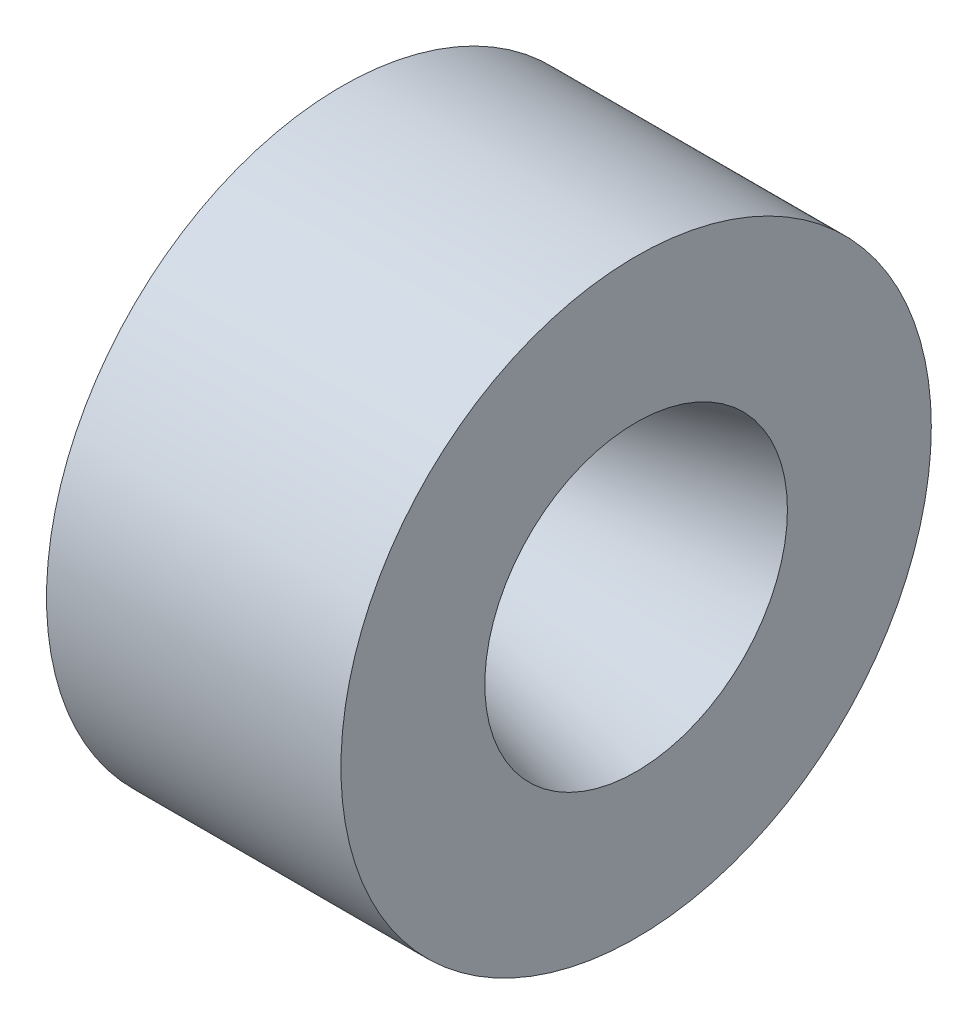
ISO-10303-21;
HEADER;
FILE_DESCRIPTION(('STEP AP214'),'2;1');
FILE_NAME('part.step','',(''),(''),'','','');
FILE_SCHEMA(('AUTOMOTIVE_DESIGN { 1 0 10303 214 1 1 1 1 }'));
ENDSEC;
DATA;
#1=APPLICATION_CONTEXT('core data for automotive mechanical design processes');
#2=APPLICATION_PROTOCOL_DEFINITION('international standard','automotive_design',2000,#1);
#3=PRODUCT_CONTEXT('',#1,'mechanical');
#4=PRODUCT('Part','Part','',(#3));
#5=PRODUCT_RELATED_PRODUCT_CATEGORY('part','',(#4));
#6=PRODUCT_DEFINITION_FORMATION('','',#4);
#7=PRODUCT_DEFINITION_CONTEXT('part definition',#1,'design');
#8=PRODUCT_DEFINITION('design','',#6,#7);
#9=PRODUCT_DEFINITION_SHAPE('','',#8);
#10=(LENGTH_UNIT() NAMED_UNIT(*) SI_UNIT(.MILLI.,.METRE.));
#11=(NAMED_UNIT(*) PLANE_ANGLE_UNIT() SI_UNIT($,.RADIAN.));
#12=(NAMED_UNIT(*) SI_UNIT($,.STERADIAN.) SOLID_ANGLE_UNIT());
#13=UNCERTAINTY_MEASURE_WITH_UNIT(LENGTH_MEASURE(1.E-05),#10,'distance_accuracy_value','');
#14=(GEOMETRIC_REPRESENTATION_CONTEXT(3) GLOBAL_UNCERTAINTY_ASSIGNED_CONTEXT((#13)) GLOBAL_UNIT_ASSIGNED_CONTEXT((#10,
#11,#12)) REPRESENTATION_CONTEXT('',''));
#15=CARTESIAN_POINT('',(0.,0.,0.));
#16=DIRECTION('',(0.,0.,1.));
#17=DIRECTION('',(1.,0.,0.));
#18=AXIS2_PLACEMENT_3D('',#15,#16,#17);
#19=CARTESIAN_POINT('',(152.7302,0.,0.));
#20=DIRECTION('',(1.,0.,0.));
#21=DIRECTION('',(0.,0.,-1.));
#22=AXIS2_PLACEMENT_3D('',#19,#20,#21);
#23=CYLINDRICAL_SURFACE('',#22,50.546);
#24=CARTESIAN_POINT('',(154.3304,0.,0.));
#25=DIRECTION('',(1.,0.,0.));
#26=DIRECTION('',(0.,0.,-1.));
#27=AXIS2_PLACEMENT_3D('',#24,#25,#26);
#28=CIRCLE('',#27,50.546);
#29=CARTESIAN_POINT('',(154.3304,0.,-50.546));
#30=VERTEX_POINT('',#29);
#31=EDGE_CURVE('E62',#30,#30,#28,.T.);
#32=ORIENTED_EDGE('',*,*,#31,.T.);
#33=EDGE_LOOP('',(#32));
#34=FACE_BOUND('',#33,.T.);
#35=CARTESIAN_POINT('',(204.742077662236,0.,0.));
#36=DIRECTION('',(1.,0.,0.));
#37=DIRECTION('',(0.,0.,-1.));
#38=AXIS2_PLACEMENT_3D('',#35,#36,#37);
#39=CIRCLE('',#38,50.546);
#40=CARTESIAN_POINT('',(204.742077662236,0.,-50.546));
#41=VERTEX_POINT('',#40);
#42=EDGE_CURVE('E74',#41,#41,#39,.T.);
#43=ORIENTED_EDGE('',*,*,#42,.F.);
#44=EDGE_LOOP('',(#43));
#45=FACE_BOUND('',#44,.T.);
#46=ADVANCED_FACE('F36',(#34,#45),#23,.T.);
#47=CARTESIAN_POINT('',(154.3304,50.546,0.));
#48=DIRECTION('',(-1.,0.,0.));
#49=DIRECTION('',(0.,0.,1.));
#50=AXIS2_PLACEMENT_3D('',#47,#48,#49);
#51=PLANE('',#50);
#52=CARTESIAN_POINT('',(154.3304,0.,0.));
#53=DIRECTION('',(-1.,0.,0.));
#54=DIRECTION('',(0.,0.,1.));
#55=AXIS2_PLACEMENT_3D('',#52,#53,#54);
#56=CIRCLE('',#55,43.942);
#57=CARTESIAN_POINT('',(154.3304,0.,43.942));
#58=VERTEX_POINT('',#57);
#59=EDGE_CURVE('E59',#58,#58,#56,.F.);
#60=ORIENTED_EDGE('',*,*,#59,.T.);
#61=EDGE_LOOP('',(#60));
#62=FACE_BOUND('',#61,.T.);
#63=ORIENTED_EDGE('',*,*,#31,.F.);
#64=EDGE_LOOP('',(#63));
#65=FACE_BOUND('',#64,.T.);
#66=ADVANCED_FACE('F82',(#62,#65),#51,.T.);
#67=CARTESIAN_POINT('',(152.7302,0.,0.));
#68=DIRECTION('',(1.,0.,0.));
#69=DIRECTION('',(0.,0.,-1.));
#70=AXIS2_PLACEMENT_3D('',#67,#68,#69);
#71=CYLINDRICAL_SURFACE('',#70,43.688);
#72=CARTESIAN_POINT('',(154.0764,0.,0.));
#73=DIRECTION('',(-1.,0.,0.));
#74=DIRECTION('',(0.,0.,1.));
#75=AXIS2_PLACEMENT_3D('',#72,#73,#74);
#76=CIRCLE('',#75,43.688);
#77=CARTESIAN_POINT('',(154.0764,0.,43.688));
#78=VERTEX_POINT('',#77);
#79=EDGE_CURVE('E56',#78,#78,#76,.T.);
#80=ORIENTED_EDGE('',*,*,#79,.T.);
#81=EDGE_LOOP('',(#80));
#82=FACE_BOUND('',#81,.T.);
#83=CARTESIAN_POINT('',(151.7904,0.,0.));
#84=DIRECTION('',(1.,0.,0.));
#85=DIRECTION('',(0.,0.,-1.));
#86=AXIS2_PLACEMENT_3D('',#83,#84,#85);
#87=CIRCLE('',#86,43.688);
#88=CARTESIAN_POINT('',(151.7904,0.,-43.688));
#89=VERTEX_POINT('',#88);
#90=EDGE_CURVE('E65',#89,#89,#87,.T.);
#91=ORIENTED_EDGE('',*,*,#90,.T.);
#92=EDGE_LOOP('',(#91));
#93=FACE_BOUND('',#92,.T.);
#94=ADVANCED_FACE('F88',(#82,#93),#71,.T.);
#95=CARTESIAN_POINT('',(151.7904,43.688,0.));
#96=DIRECTION('',(-1.,0.,0.));
#97=DIRECTION('',(0.,0.,1.));
#98=AXIS2_PLACEMENT_3D('',#95,#96,#97);
#99=PLANE('',#98);
#100=CARTESIAN_POINT('',(151.7904,0.,0.));
#101=DIRECTION('',(1.,0.,0.));
#102=DIRECTION('',(0.,0.,-1.));
#103=AXIS2_PLACEMENT_3D('',#100,#101,#102);
#104=CIRCLE('',#103,41.148);
#105=CARTESIAN_POINT('',(151.7904,0.,-41.148));
#106=VERTEX_POINT('',#105);
#107=EDGE_CURVE('E68',#106,#106,#104,.T.);
#108=ORIENTED_EDGE('',*,*,#107,.T.);
#109=EDGE_LOOP('',(#108));
#110=FACE_BOUND('',#109,.T.);
#111=ORIENTED_EDGE('',*,*,#90,.F.);
#112=EDGE_LOOP('',(#111));
#113=FACE_BOUND('',#112,.T.);
#114=ADVANCED_FACE('F118',(#110,#113),#99,.T.);
#115=CARTESIAN_POINT('',(152.7302,0.,0.));
#116=DIRECTION('',(1.,0.,0.));
#117=DIRECTION('',(0.,0.,-1.));
#118=AXIS2_PLACEMENT_3D('',#115,#116,#117);
#119=CYLINDRICAL_SURFACE('',#118,41.148);
#120=CARTESIAN_POINT('',(152.347039537398,0.,0.));
#121=DIRECTION('',(1.,0.,0.));
#122=DIRECTION('',(0.,0.,-1.));
#123=AXIS2_PLACEMENT_3D('',#120,#121,#122);
#124=CIRCLE('',#123,41.148);
#125=CARTESIAN_POINT('',(152.347039537398,0.,-41.148));
#126=VERTEX_POINT('',#125);
#127=EDGE_CURVE('E43',#126,#126,#124,.T.);
#128=ORIENTED_EDGE('',*,*,#127,.T.);
#129=EDGE_LOOP('',(#128));
#130=FACE_BOUND('',#129,.T.);
#131=ORIENTED_EDGE('',*,*,#107,.F.);
#132=EDGE_LOOP('',(#131));
#133=FACE_BOUND('',#132,.T.);
#134=ADVANCED_FACE('F110',(#130,#133),#119,.F.);
#135=CARTESIAN_POINT('',(154.3304,0.,0.));
#136=DIRECTION('',(-1.,0.,0.));
#137=DIRECTION('',(0.,0.,1.));
#138=AXIS2_PLACEMENT_3D('',#135,#136,#137);
#139=CONICAL_SURFACE('',#138,41.148,0.959931088596884);
#140=CARTESIAN_POINT('',(155.468008826139,0.,0.));
#141=DIRECTION('',(-1.,0.,0.));
#142=DIRECTION('',(0.,0.,1.));
#143=AXIS2_PLACEMENT_3D('',#140,#141,#142);
#144=CIRCLE('',#143,39.5233262224975);
#145=CARTESIAN_POINT('',(155.468008826139,0.,39.5233262224975));
#146=VERTEX_POINT('',#145);
#147=EDGE_CURVE('E10',#146,#146,#144,.T.);
#148=ORIENTED_EDGE('',*,*,#147,.T.);
#149=EDGE_LOOP('',(#148));
#150=FACE_BOUND('',#149,.T.);
#151=CARTESIAN_POINT('',(170.769703079932,0.,0.));
#152=DIRECTION('',(1.,0.,0.));
#153=DIRECTION('',(0.,0.,-1.));
#154=AXIS2_PLACEMENT_3D('',#151,#152,#153);
#155=CIRCLE('',#154,17.6702420741658);
#156=CARTESIAN_POINT('',(170.769703079932,0.,-17.6702420741658));
#157=VERTEX_POINT('',#156);
#158=EDGE_CURVE('E51',#157,#157,#155,.T.);
#159=ORIENTED_EDGE('',*,*,#158,.T.);
#160=EDGE_LOOP('',(#159));
#161=FACE_BOUND('',#160,.T.);
#162=ADVANCED_FACE('F107',(#150,#161),#139,.F.);
#163=CARTESIAN_POINT('',(171.279763711412,0.,0.));
#164=DIRECTION('',(1.,0.,0.));
#165=DIRECTION('',(0.,0.,-1.));
#166=AXIS2_PLACEMENT_3D('',#163,#164,#165);
#167=CONICAL_SURFACE('',#166,16.9418,0.26179938779915);
#168=CARTESIAN_POINT('',(172.138726363459,0.,0.));
#169=DIRECTION('',(-1.,0.,0.));
#170=DIRECTION('',(0.,0.,1.));
#171=AXIS2_PLACEMENT_3D('',#168,#169,#170);
#172=CIRCLE('',#171,17.1719583489445);
#173=CARTESIAN_POINT('',(172.138726363459,0.,17.1719583489445));
#174=VERTEX_POINT('',#173);
#175=EDGE_CURVE('E47',#174,#174,#172,.T.);
#176=ORIENTED_EDGE('',*,*,#175,.T.);
#177=EDGE_LOOP('',(#176));
#178=FACE_BOUND('',#177,.T.);
#179=CARTESIAN_POINT('',(204.742077662236,0.,0.));
#180=DIRECTION('',(1.,0.,0.));
#181=DIRECTION('',(0.,0.,-1.));
#182=AXIS2_PLACEMENT_3D('',#179,#180,#181);
#183=CIRCLE('',#182,25.908);
#184=CARTESIAN_POINT('',(204.742077662236,0.,-25.908));
#185=VERTEX_POINT('',#184);
#186=EDGE_CURVE('E71',#185,#185,#183,.T.);
#187=ORIENTED_EDGE('',*,*,#186,.T.);
#188=EDGE_LOOP('',(#187));
#189=FACE_BOUND('',#188,.T.);
#190=ADVANCED_FACE('F109',(#178,#189),#167,.F.);
#191=CARTESIAN_POINT('',(204.742077662236,25.908,0.));
#192=DIRECTION('',(1.,0.,0.));
#193=DIRECTION('',(0.,0.,-1.));
#194=AXIS2_PLACEMENT_3D('',#191,#192,#193);
#195=PLANE('',#194);
#196=ORIENTED_EDGE('',*,*,#42,.T.);
#197=EDGE_LOOP('',(#196));
#198=FACE_BOUND('',#197,.T.);
#199=ORIENTED_EDGE('',*,*,#186,.F.);
#200=EDGE_LOOP('',(#199));
#201=FACE_BOUND('',#200,.T.);
#202=ADVANCED_FACE('F78',(#198,#201),#195,.T.);
#203=CARTESIAN_POINT('',(154.0764,0.,0.));
#204=DIRECTION('',(-1.,0.,0.));
#205=DIRECTION('',(0.,0.,1.));
#206=AXIS2_PLACEMENT_3D('',#203,#204,#205);
#207=TOROIDAL_SURFACE('',#206,43.942,0.254);
#208=ORIENTED_EDGE('',*,*,#79,.F.);
#209=EDGE_LOOP('',(#208));
#210=FACE_BOUND('',#209,.T.);
#211=ORIENTED_EDGE('',*,*,#59,.F.);
#212=EDGE_LOOP('',(#211));
#213=FACE_BOUND('',#212,.T.);
#214=ADVANCED_FACE('F93',(#210,#213),#207,.F.);
#215=CARTESIAN_POINT('',(171.810026176179,0.,0.));
#216=DIRECTION('',(-1.,0.,0.));
#217=DIRECTION('',(0.,0.,1.));
#218=AXIS2_PLACEMENT_3D('',#215,#216,#217);
#219=TOROIDAL_SURFACE('',#218,18.3986841483317,1.27);
#220=ORIENTED_EDGE('',*,*,#175,.F.);
#221=EDGE_LOOP('',(#220));
#222=FACE_BOUND('',#221,.T.);
#223=ORIENTED_EDGE('',*,*,#158,.F.);
#224=EDGE_LOOP('',(#223));
#225=FACE_BOUND('',#224,.T.);
#226=ADVANCED_FACE('F95',(#222,#225),#219,.T.);
#227=CARTESIAN_POINT('',(152.347039537398,0.,0.));
#228=DIRECTION('',(1.,0.,0.));
#229=DIRECTION('',(0.,0.,-1.));
#230=AXIS2_PLACEMENT_3D('',#227,#228,#229);
#231=TOROIDAL_SURFACE('',#230,37.338,3.81);
#232=ORIENTED_EDGE('',*,*,#147,.F.);
#233=EDGE_LOOP('',(#232));
#234=FACE_BOUND('',#233,.T.);
#235=ORIENTED_EDGE('',*,*,#127,.F.);
#236=EDGE_LOOP('',(#235));
#237=FACE_BOUND('',#236,.T.);
#238=ADVANCED_FACE('F38',(#234,#237),#231,.F.);
#239=CLOSED_SHELL('',(#46,#66,#94,#114,#134,#162,#190,#202,#214,#226,#238));
#240=MANIFOLD_SOLID_BREP('B2',#239);
#241=ADVANCED_BREP_SHAPE_REPRESENTATION('',(#18,#240),#14);
#242=SHAPE_DEFINITION_REPRESENTATION(#9,#241);
ENDSEC;
END-ISO-10303-21;
